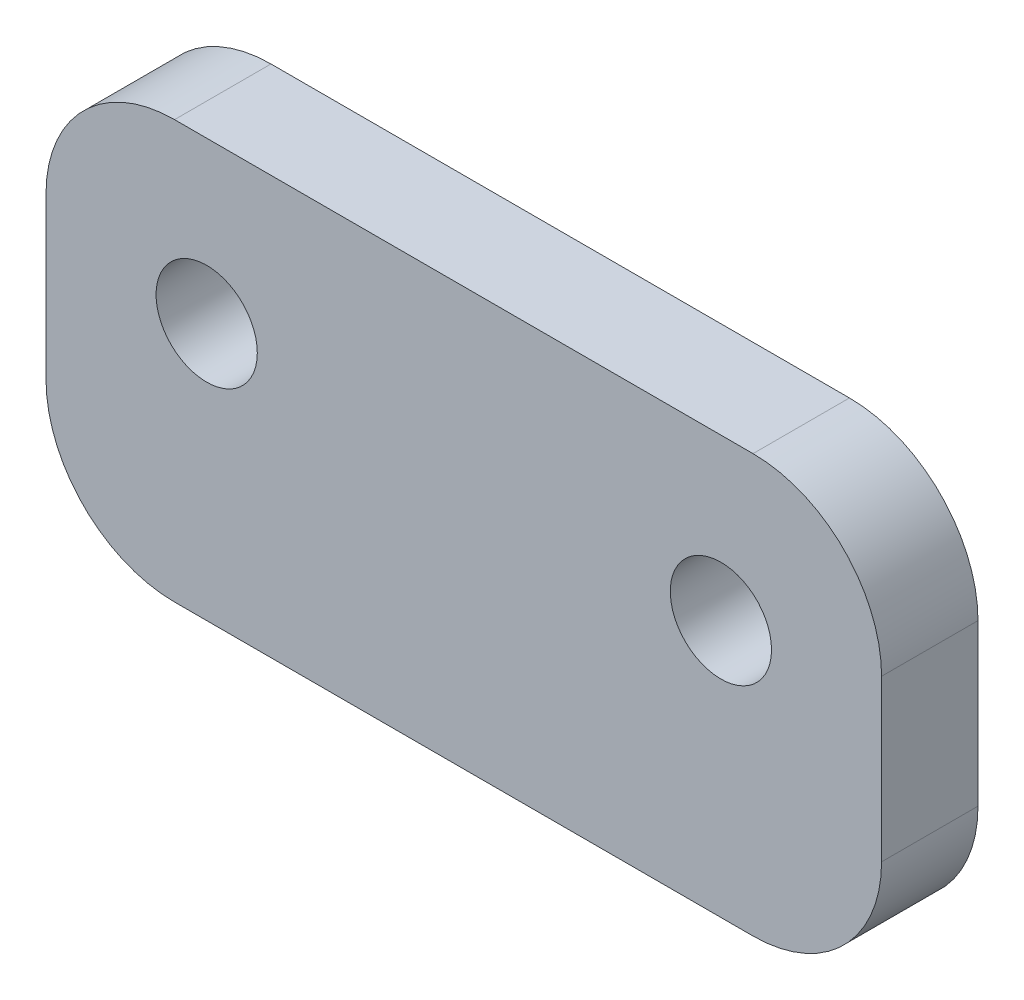
ISO-10303-21;
HEADER;
FILE_DESCRIPTION(('STEP AP214'),'2;1');
FILE_NAME('part.step','',(''),(''),'','','');
FILE_SCHEMA(('AUTOMOTIVE_DESIGN { 1 0 10303 214 1 1 1 1 }'));
ENDSEC;
DATA;
#1=APPLICATION_CONTEXT('core data for automotive mechanical design processes');
#2=APPLICATION_PROTOCOL_DEFINITION('international standard','automotive_design',2000,#1);
#3=PRODUCT_CONTEXT('',#1,'mechanical');
#4=PRODUCT('Part','Part','',(#3));
#5=PRODUCT_RELATED_PRODUCT_CATEGORY('part','',(#4));
#6=PRODUCT_DEFINITION_FORMATION('','',#4);
#7=PRODUCT_DEFINITION_CONTEXT('part definition',#1,'design');
#8=PRODUCT_DEFINITION('design','',#6,#7);
#9=PRODUCT_DEFINITION_SHAPE('','',#8);
#10=(LENGTH_UNIT() NAMED_UNIT(*) SI_UNIT(.MILLI.,.METRE.));
#11=(NAMED_UNIT(*) PLANE_ANGLE_UNIT() SI_UNIT($,.RADIAN.));
#12=(NAMED_UNIT(*) SI_UNIT($,.STERADIAN.) SOLID_ANGLE_UNIT());
#13=UNCERTAINTY_MEASURE_WITH_UNIT(LENGTH_MEASURE(1.E-05),#10,'distance_accuracy_value','');
#14=(GEOMETRIC_REPRESENTATION_CONTEXT(3) GLOBAL_UNCERTAINTY_ASSIGNED_CONTEXT((#13)) GLOBAL_UNIT_ASSIGNED_CONTEXT((#10,
#11,#12)) REPRESENTATION_CONTEXT('',''));
#15=CARTESIAN_POINT('',(0.,0.,0.));
#16=DIRECTION('',(0.,0.,1.));
#17=DIRECTION('',(1.,0.,0.));
#18=AXIS2_PLACEMENT_3D('',#15,#16,#17);
#19=CARTESIAN_POINT('',(-20.6375,-10.31875,4.7625));
#20=DIRECTION('',(0.,0.,-1.));
#21=DIRECTION('',(-1.,0.,0.));
#22=AXIS2_PLACEMENT_3D('',#19,#20,#21);
#23=PLANE('',#22);
#24=DIRECTION('',(-1.,0.,0.));
#25=VECTOR('',#24,1.);
#26=CARTESIAN_POINT('',(20.6375,10.31875,4.7625));
#27=LINE('',#26,#25);
#28=CARTESIAN_POINT('',(14.2875,10.31875,4.7625));
#29=VERTEX_POINT('',#28);
#30=CARTESIAN_POINT('',(-14.2875,10.31875,4.7625));
#31=VERTEX_POINT('',#30);
#32=EDGE_CURVE('E151',#29,#31,#27,.T.);
#33=ORIENTED_EDGE('',*,*,#32,.T.);
#34=CARTESIAN_POINT('',(-14.2875,3.96875,4.7625));
#35=DIRECTION('',(0.,0.,-1.));
#36=DIRECTION('',(-1.,0.,0.));
#37=AXIS2_PLACEMENT_3D('',#34,#35,#36);
#38=CIRCLE('',#37,6.35);
#39=CARTESIAN_POINT('',(-20.6375,3.96875,4.7625));
#40=VERTEX_POINT('',#39);
#41=EDGE_CURVE('E181',#31,#40,#38,.F.);
#42=ORIENTED_EDGE('',*,*,#41,.T.);
#43=DIRECTION('',(0.,-1.,0.));
#44=VECTOR('',#43,1.);
#45=CARTESIAN_POINT('',(-20.6375,10.31875,4.7625));
#46=LINE('',#45,#44);
#47=CARTESIAN_POINT('',(-20.6375,-3.96875,4.7625));
#48=VERTEX_POINT('',#47);
#49=EDGE_CURVE('E131',#40,#48,#46,.T.);
#50=ORIENTED_EDGE('',*,*,#49,.T.);
#51=CARTESIAN_POINT('',(-14.2875,-3.96875,4.7625));
#52=DIRECTION('',(0.,0.,-1.));
#53=DIRECTION('',(-1.,0.,0.));
#54=AXIS2_PLACEMENT_3D('',#51,#52,#53);
#55=CIRCLE('',#54,6.35);
#56=CARTESIAN_POINT('',(-14.2875,-10.31875,4.7625));
#57=VERTEX_POINT('',#56);
#58=EDGE_CURVE('E173',#48,#57,#55,.F.);
#59=ORIENTED_EDGE('',*,*,#58,.T.);
#60=DIRECTION('',(1.,0.,0.));
#61=VECTOR('',#60,1.);
#62=CARTESIAN_POINT('',(20.6375,-10.31875,4.7625));
#63=LINE('',#62,#61);
#64=CARTESIAN_POINT('',(14.2875,-10.31875,4.7625));
#65=VERTEX_POINT('',#64);
#66=EDGE_CURVE('E196',#57,#65,#63,.T.);
#67=ORIENTED_EDGE('',*,*,#66,.T.);
#68=CARTESIAN_POINT('',(14.2875,-3.96875,4.7625));
#69=DIRECTION('',(0.,0.,-1.));
#70=DIRECTION('',(-1.,0.,0.));
#71=AXIS2_PLACEMENT_3D('',#68,#69,#70);
#72=CIRCLE('',#71,6.35);
#73=CARTESIAN_POINT('',(20.6375,-3.96875,4.7625));
#74=VERTEX_POINT('',#73);
#75=EDGE_CURVE('E66',#65,#74,#72,.F.);
#76=ORIENTED_EDGE('',*,*,#75,.T.);
#77=DIRECTION('',(0.,1.,0.));
#78=VECTOR('',#77,1.);
#79=CARTESIAN_POINT('',(20.6375,10.31875,4.7625));
#80=LINE('',#79,#78);
#81=CARTESIAN_POINT('',(20.6375,3.96875,4.7625));
#82=VERTEX_POINT('',#81);
#83=EDGE_CURVE('E204',#74,#82,#80,.T.);
#84=ORIENTED_EDGE('',*,*,#83,.T.);
#85=CARTESIAN_POINT('',(14.2875,3.96875,4.7625));
#86=DIRECTION('',(0.,0.,-1.));
#87=DIRECTION('',(-1.,0.,0.));
#88=AXIS2_PLACEMENT_3D('',#85,#86,#87);
#89=CIRCLE('',#88,6.35);
#90=EDGE_CURVE('E178',#82,#29,#89,.F.);
#91=ORIENTED_EDGE('',*,*,#90,.T.);
#92=EDGE_LOOP('',(#33,#42,#50,#59,#67,#76,#84,#91));
#93=FACE_BOUND('',#92,.T.);
#94=CARTESIAN_POINT('',(12.7,2.38124999999999,4.7625));
#95=DIRECTION('',(0.,0.,1.));
#96=DIRECTION('',(1.,0.,0.));
#97=AXIS2_PLACEMENT_3D('',#94,#95,#96);
#98=CIRCLE('',#97,2.49999999999999);
#99=CARTESIAN_POINT('',(15.2,2.38124999999999,4.7625));
#100=VERTEX_POINT('',#99);
#101=EDGE_CURVE('E148',#100,#100,#98,.T.);
#102=ORIENTED_EDGE('',*,*,#101,.F.);
#103=EDGE_LOOP('',(#102));
#104=FACE_BOUND('',#103,.T.);
#105=CARTESIAN_POINT('',(-12.7,2.38124999999999,4.7625));
#106=DIRECTION('',(0.,0.,1.));
#107=DIRECTION('',(1.,0.,0.));
#108=AXIS2_PLACEMENT_3D('',#105,#106,#107);
#109=CIRCLE('',#108,2.49999999999999);
#110=CARTESIAN_POINT('',(-10.2,2.38124999999999,4.7625));
#111=VERTEX_POINT('',#110);
#112=EDGE_CURVE('E221',#111,#111,#109,.T.);
#113=ORIENTED_EDGE('',*,*,#112,.F.);
#114=EDGE_LOOP('',(#113));
#115=FACE_BOUND('',#114,.T.);
#116=ADVANCED_FACE('F43',(#93,#104,#115),#23,.F.);
#117=CARTESIAN_POINT('',(-20.6375,10.31875,4.7625));
#118=DIRECTION('',(1.,0.,0.));
#119=DIRECTION('',(0.,1.,0.));
#120=AXIS2_PLACEMENT_3D('',#117,#118,#119);
#121=PLANE('',#120);
#122=ORIENTED_EDGE('',*,*,#49,.F.);
#123=DIRECTION('',(0.,0.,-1.));
#124=VECTOR('',#123,1.);
#125=CARTESIAN_POINT('',(-20.6375,3.96875,4.7625));
#126=LINE('',#125,#124);
#127=CARTESIAN_POINT('',(-20.6375,3.96875,0.));
#128=VERTEX_POINT('',#127);
#129=EDGE_CURVE('E114',#40,#128,#126,.T.);
#130=ORIENTED_EDGE('',*,*,#129,.T.);
#131=DIRECTION('',(0.,-1.,0.));
#132=VECTOR('',#131,1.);
#133=CARTESIAN_POINT('',(-20.6375,10.31875,0.));
#134=LINE('',#133,#132);
#135=CARTESIAN_POINT('',(-20.6375,-3.96875,0.));
#136=VERTEX_POINT('',#135);
#137=EDGE_CURVE('E128',#128,#136,#134,.T.);
#138=ORIENTED_EDGE('',*,*,#137,.T.);
#139=DIRECTION('',(0.,0.,-1.));
#140=VECTOR('',#139,1.);
#141=CARTESIAN_POINT('',(-20.6375,-3.96875,4.7625));
#142=LINE('',#141,#140);
#143=EDGE_CURVE('E134',#136,#48,#142,.F.);
#144=ORIENTED_EDGE('',*,*,#143,.T.);
#145=EDGE_LOOP('',(#122,#130,#138,#144));
#146=FACE_BOUND('',#145,.T.);
#147=ADVANCED_FACE('F127',(#146),#121,.F.);
#148=CARTESIAN_POINT('',(20.6375,-10.31875,4.7625));
#149=DIRECTION('',(0.,1.,0.));
#150=DIRECTION('',(-1.,0.,0.));
#151=AXIS2_PLACEMENT_3D('',#148,#149,#150);
#152=PLANE('',#151);
#153=DIRECTION('',(1.,0.,0.));
#154=VECTOR('',#153,1.);
#155=CARTESIAN_POINT('',(20.6375,-10.31875,0.));
#156=LINE('',#155,#154);
#157=CARTESIAN_POINT('',(-14.2875,-10.31875,0.));
#158=VERTEX_POINT('',#157);
#159=CARTESIAN_POINT('',(14.2875,-10.31875,0.));
#160=VERTEX_POINT('',#159);
#161=EDGE_CURVE('E139',#158,#160,#156,.T.);
#162=ORIENTED_EDGE('',*,*,#161,.T.);
#163=DIRECTION('',(0.,0.,-1.));
#164=VECTOR('',#163,1.);
#165=CARTESIAN_POINT('',(14.2875,-10.31875,4.7625));
#166=LINE('',#165,#164);
#167=EDGE_CURVE('E11',#160,#65,#166,.F.);
#168=ORIENTED_EDGE('',*,*,#167,.T.);
#169=ORIENTED_EDGE('',*,*,#66,.F.);
#170=DIRECTION('',(0.,0.,-1.));
#171=VECTOR('',#170,1.);
#172=CARTESIAN_POINT('',(-14.2875,-10.31875,4.7625));
#173=LINE('',#172,#171);
#174=EDGE_CURVE('E52',#57,#158,#173,.T.);
#175=ORIENTED_EDGE('',*,*,#174,.T.);
#176=EDGE_LOOP('',(#162,#168,#169,#175));
#177=FACE_BOUND('',#176,.T.);
#178=ADVANCED_FACE('F194',(#177),#152,.F.);
#179=CARTESIAN_POINT('',(20.6375,10.31875,4.7625));
#180=DIRECTION('',(-1.,0.,0.));
#181=DIRECTION('',(0.,-1.,0.));
#182=AXIS2_PLACEMENT_3D('',#179,#180,#181);
#183=PLANE('',#182);
#184=DIRECTION('',(0.,1.,0.));
#185=VECTOR('',#184,1.);
#186=CARTESIAN_POINT('',(20.6375,10.31875,0.));
#187=LINE('',#186,#185);
#188=CARTESIAN_POINT('',(20.6375,-3.96875,0.));
#189=VERTEX_POINT('',#188);
#190=CARTESIAN_POINT('',(20.6375,3.96875,0.));
#191=VERTEX_POINT('',#190);
#192=EDGE_CURVE('E145',#189,#191,#187,.T.);
#193=ORIENTED_EDGE('',*,*,#192,.T.);
#194=DIRECTION('',(0.,0.,-1.));
#195=VECTOR('',#194,1.);
#196=CARTESIAN_POINT('',(20.6375,3.96875,4.7625));
#197=LINE('',#196,#195);
#198=EDGE_CURVE('E59',#191,#82,#197,.F.);
#199=ORIENTED_EDGE('',*,*,#198,.T.);
#200=ORIENTED_EDGE('',*,*,#83,.F.);
#201=DIRECTION('',(0.,0.,-1.));
#202=VECTOR('',#201,1.);
#203=CARTESIAN_POINT('',(20.6375,-3.96875,4.7625));
#204=LINE('',#203,#202);
#205=EDGE_CURVE('E184',#74,#189,#204,.T.);
#206=ORIENTED_EDGE('',*,*,#205,.T.);
#207=EDGE_LOOP('',(#193,#199,#200,#206));
#208=FACE_BOUND('',#207,.T.);
#209=ADVANCED_FACE('F203',(#208),#183,.F.);
#210=CARTESIAN_POINT('',(20.6375,10.31875,4.7625));
#211=DIRECTION('',(0.,-1.,0.));
#212=DIRECTION('',(1.,0.,0.));
#213=AXIS2_PLACEMENT_3D('',#210,#211,#212);
#214=PLANE('',#213);
#215=DIRECTION('',(-1.,0.,0.));
#216=VECTOR('',#215,1.);
#217=CARTESIAN_POINT('',(20.6375,10.31875,0.));
#218=LINE('',#217,#216);
#219=CARTESIAN_POINT('',(14.2875,10.31875,0.));
#220=VERTEX_POINT('',#219);
#221=CARTESIAN_POINT('',(-14.2875,10.31875,0.));
#222=VERTEX_POINT('',#221);
#223=EDGE_CURVE('E156',#220,#222,#218,.T.);
#224=ORIENTED_EDGE('',*,*,#223,.T.);
#225=DIRECTION('',(0.,0.,-1.));
#226=VECTOR('',#225,1.);
#227=CARTESIAN_POINT('',(-14.2875,10.31875,4.7625));
#228=LINE('',#227,#226);
#229=EDGE_CURVE('E115',#222,#31,#228,.F.);
#230=ORIENTED_EDGE('',*,*,#229,.T.);
#231=ORIENTED_EDGE('',*,*,#32,.F.);
#232=DIRECTION('',(0.,0.,-1.));
#233=VECTOR('',#232,1.);
#234=CARTESIAN_POINT('',(14.2875,10.31875,4.7625));
#235=LINE('',#234,#233);
#236=EDGE_CURVE('E121',#29,#220,#235,.T.);
#237=ORIENTED_EDGE('',*,*,#236,.T.);
#238=EDGE_LOOP('',(#224,#230,#231,#237));
#239=FACE_BOUND('',#238,.T.);
#240=ADVANCED_FACE('F242',(#239),#214,.F.);
#241=CARTESIAN_POINT('',(-20.6375,-10.31875,0.));
#242=DIRECTION('',(0.,0.,-1.));
#243=DIRECTION('',(-1.,0.,0.));
#244=AXIS2_PLACEMENT_3D('',#241,#242,#243);
#245=PLANE('',#244);
#246=CARTESIAN_POINT('',(-12.7,2.38124999999999,0.));
#247=DIRECTION('',(0.,0.,-1.));
#248=DIRECTION('',(-1.,0.,0.));
#249=AXIS2_PLACEMENT_3D('',#246,#247,#248);
#250=CIRCLE('',#249,2.49999999999999);
#251=CARTESIAN_POINT('',(-15.2,2.38124999999999,0.));
#252=VERTEX_POINT('',#251);
#253=EDGE_CURVE('E217',#252,#252,#250,.T.);
#254=ORIENTED_EDGE('',*,*,#253,.F.);
#255=EDGE_LOOP('',(#254));
#256=FACE_BOUND('',#255,.T.);
#257=CARTESIAN_POINT('',(12.7,2.38124999999999,0.));
#258=DIRECTION('',(0.,0.,-1.));
#259=DIRECTION('',(-1.,0.,0.));
#260=AXIS2_PLACEMENT_3D('',#257,#258,#259);
#261=CIRCLE('',#260,2.49999999999999);
#262=CARTESIAN_POINT('',(10.2,2.38124999999999,0.));
#263=VERTEX_POINT('',#262);
#264=EDGE_CURVE('E140',#263,#263,#261,.T.);
#265=ORIENTED_EDGE('',*,*,#264,.F.);
#266=EDGE_LOOP('',(#265));
#267=FACE_BOUND('',#266,.T.);
#268=ORIENTED_EDGE('',*,*,#137,.F.);
#269=CARTESIAN_POINT('',(-14.2875,3.96875,0.));
#270=DIRECTION('',(0.,0.,-1.));
#271=DIRECTION('',(-1.,0.,0.));
#272=AXIS2_PLACEMENT_3D('',#269,#270,#271);
#273=CIRCLE('',#272,6.35);
#274=EDGE_CURVE('E110',#128,#222,#273,.T.);
#275=ORIENTED_EDGE('',*,*,#274,.T.);
#276=ORIENTED_EDGE('',*,*,#223,.F.);
#277=CARTESIAN_POINT('',(14.2875,3.96875,0.));
#278=DIRECTION('',(0.,0.,-1.));
#279=DIRECTION('',(-1.,0.,0.));
#280=AXIS2_PLACEMENT_3D('',#277,#278,#279);
#281=CIRCLE('',#280,6.35);
#282=EDGE_CURVE('E122',#220,#191,#281,.T.);
#283=ORIENTED_EDGE('',*,*,#282,.T.);
#284=ORIENTED_EDGE('',*,*,#192,.F.);
#285=CARTESIAN_POINT('',(14.2875,-3.96875,0.));
#286=DIRECTION('',(0.,0.,-1.));
#287=DIRECTION('',(-1.,0.,0.));
#288=AXIS2_PLACEMENT_3D('',#285,#286,#287);
#289=CIRCLE('',#288,6.35);
#290=EDGE_CURVE('E163',#189,#160,#289,.T.);
#291=ORIENTED_EDGE('',*,*,#290,.T.);
#292=ORIENTED_EDGE('',*,*,#161,.F.);
#293=CARTESIAN_POINT('',(-14.2875,-3.96875,0.));
#294=DIRECTION('',(0.,0.,-1.));
#295=DIRECTION('',(-1.,0.,0.));
#296=AXIS2_PLACEMENT_3D('',#293,#294,#295);
#297=CIRCLE('',#296,6.35);
#298=EDGE_CURVE('E133',#158,#136,#297,.T.);
#299=ORIENTED_EDGE('',*,*,#298,.T.);
#300=EDGE_LOOP('',(#268,#275,#276,#283,#284,#291,#292,#299));
#301=FACE_BOUND('',#300,.T.);
#302=ADVANCED_FACE('F136',(#256,#267,#301),#245,.T.);
#303=CARTESIAN_POINT('',(-14.2875,3.96875,4.7625));
#304=DIRECTION('',(0.,0.,-1.));
#305=DIRECTION('',(-1.,0.,0.));
#306=AXIS2_PLACEMENT_3D('',#303,#304,#305);
#307=CYLINDRICAL_SURFACE('',#306,6.35);
#308=ORIENTED_EDGE('',*,*,#41,.F.);
#309=ORIENTED_EDGE('',*,*,#229,.F.);
#310=ORIENTED_EDGE('',*,*,#274,.F.);
#311=ORIENTED_EDGE('',*,*,#129,.F.);
#312=EDGE_LOOP('',(#308,#309,#310,#311));
#313=FACE_BOUND('',#312,.T.);
#314=ADVANCED_FACE('F113',(#313),#307,.T.);
#315=CARTESIAN_POINT('',(14.2875,3.96875,4.7625));
#316=DIRECTION('',(0.,0.,-1.));
#317=DIRECTION('',(-1.,0.,0.));
#318=AXIS2_PLACEMENT_3D('',#315,#316,#317);
#319=CYLINDRICAL_SURFACE('',#318,6.35);
#320=ORIENTED_EDGE('',*,*,#90,.F.);
#321=ORIENTED_EDGE('',*,*,#198,.F.);
#322=ORIENTED_EDGE('',*,*,#282,.F.);
#323=ORIENTED_EDGE('',*,*,#236,.F.);
#324=EDGE_LOOP('',(#320,#321,#322,#323));
#325=FACE_BOUND('',#324,.T.);
#326=ADVANCED_FACE('F253',(#325),#319,.T.);
#327=CARTESIAN_POINT('',(14.2875,-3.96875,4.7625));
#328=DIRECTION('',(0.,0.,-1.));
#329=DIRECTION('',(-1.,0.,0.));
#330=AXIS2_PLACEMENT_3D('',#327,#328,#329);
#331=CYLINDRICAL_SURFACE('',#330,6.35);
#332=ORIENTED_EDGE('',*,*,#75,.F.);
#333=ORIENTED_EDGE('',*,*,#167,.F.);
#334=ORIENTED_EDGE('',*,*,#290,.F.);
#335=ORIENTED_EDGE('',*,*,#205,.F.);
#336=EDGE_LOOP('',(#332,#333,#334,#335));
#337=FACE_BOUND('',#336,.T.);
#338=ADVANCED_FACE('F202',(#337),#331,.T.);
#339=CARTESIAN_POINT('',(-14.2875,-3.96875,4.7625));
#340=DIRECTION('',(0.,0.,-1.));
#341=DIRECTION('',(-1.,0.,0.));
#342=AXIS2_PLACEMENT_3D('',#339,#340,#341);
#343=CYLINDRICAL_SURFACE('',#342,6.35);
#344=ORIENTED_EDGE('',*,*,#58,.F.);
#345=ORIENTED_EDGE('',*,*,#143,.F.);
#346=ORIENTED_EDGE('',*,*,#298,.F.);
#347=ORIENTED_EDGE('',*,*,#174,.F.);
#348=EDGE_LOOP('',(#344,#345,#346,#347));
#349=FACE_BOUND('',#348,.T.);
#350=ADVANCED_FACE('F45',(#349),#343,.T.);
#351=CARTESIAN_POINT('',(12.7,2.38124999999999,4.7625));
#352=DIRECTION('',(0.,0.,1.));
#353=DIRECTION('',(1.,0.,0.));
#354=AXIS2_PLACEMENT_3D('',#351,#352,#353);
#355=CYLINDRICAL_SURFACE('',#354,2.49999999999999);
#356=ORIENTED_EDGE('',*,*,#101,.T.);
#357=EDGE_LOOP('',(#356));
#358=FACE_BOUND('',#357,.T.);
#359=ORIENTED_EDGE('',*,*,#264,.T.);
#360=EDGE_LOOP('',(#359));
#361=FACE_BOUND('',#360,.T.);
#362=ADVANCED_FACE('F238',(#358,#361),#355,.F.);
#363=CARTESIAN_POINT('',(-12.7,2.38124999999999,4.7625));
#364=DIRECTION('',(0.,0.,1.));
#365=DIRECTION('',(1.,0.,0.));
#366=AXIS2_PLACEMENT_3D('',#363,#364,#365);
#367=CYLINDRICAL_SURFACE('',#366,2.49999999999999);
#368=ORIENTED_EDGE('',*,*,#112,.T.);
#369=EDGE_LOOP('',(#368));
#370=FACE_BOUND('',#369,.T.);
#371=ORIENTED_EDGE('',*,*,#253,.T.);
#372=EDGE_LOOP('',(#371));
#373=FACE_BOUND('',#372,.T.);
#374=ADVANCED_FACE('F226',(#370,#373),#367,.F.);
#375=CLOSED_SHELL('',(#116,#147,#178,#209,#240,#302,#314,#326,#338,#350,#362,#374));
#376=MANIFOLD_SOLID_BREP('B2',#375);
#377=ADVANCED_BREP_SHAPE_REPRESENTATION('',(#18,#376),#14);
#378=SHAPE_DEFINITION_REPRESENTATION(#9,#377);
ENDSEC;
END-ISO-10303-21;
